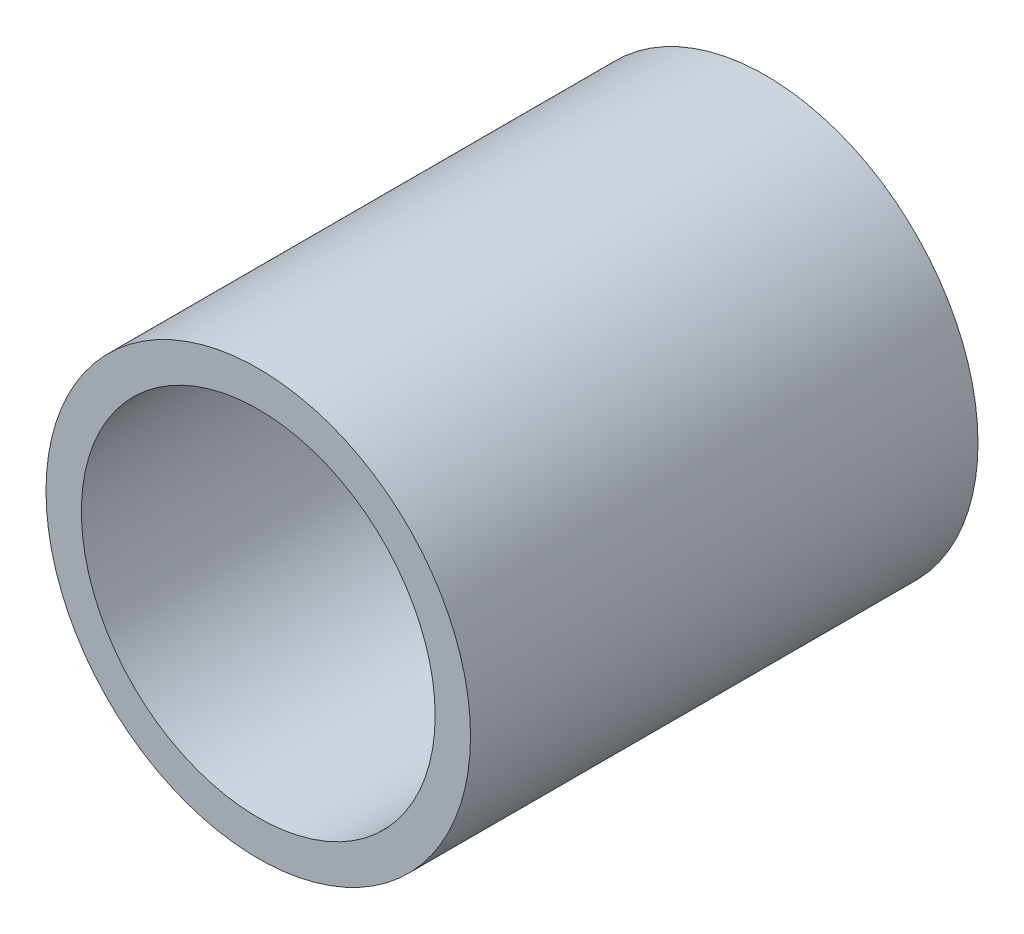
ISO-10303-21;
HEADER;
FILE_DESCRIPTION(('STEP AP214'),'2;1');
FILE_NAME('part.step','',(''),(''),'','','');
FILE_SCHEMA(('AUTOMOTIVE_DESIGN { 1 0 10303 214 1 1 1 1 }'));
ENDSEC;
DATA;
#1=APPLICATION_CONTEXT('core data for automotive mechanical design processes');
#2=APPLICATION_PROTOCOL_DEFINITION('international standard','automotive_design',2000,#1);
#3=PRODUCT_CONTEXT('',#1,'mechanical');
#4=PRODUCT('Part','Part','',(#3));
#5=PRODUCT_RELATED_PRODUCT_CATEGORY('part','',(#4));
#6=PRODUCT_DEFINITION_FORMATION('','',#4);
#7=PRODUCT_DEFINITION_CONTEXT('part definition',#1,'design');
#8=PRODUCT_DEFINITION('design','',#6,#7);
#9=PRODUCT_DEFINITION_SHAPE('','',#8);
#10=(LENGTH_UNIT() NAMED_UNIT(*) SI_UNIT(.MILLI.,.METRE.));
#11=(NAMED_UNIT(*) PLANE_ANGLE_UNIT() SI_UNIT($,.RADIAN.));
#12=(NAMED_UNIT(*) SI_UNIT($,.STERADIAN.) SOLID_ANGLE_UNIT());
#13=UNCERTAINTY_MEASURE_WITH_UNIT(LENGTH_MEASURE(1.E-05),#10,'distance_accuracy_value','');
#14=(GEOMETRIC_REPRESENTATION_CONTEXT(3) GLOBAL_UNCERTAINTY_ASSIGNED_CONTEXT((#13)) GLOBAL_UNIT_ASSIGNED_CONTEXT((#10,
#11,#12)) REPRESENTATION_CONTEXT('',''));
#15=CARTESIAN_POINT('',(0.,0.,0.));
#16=DIRECTION('',(0.,0.,1.));
#17=DIRECTION('',(1.,0.,0.));
#18=AXIS2_PLACEMENT_3D('',#15,#16,#17);
#19=CARTESIAN_POINT('',(0.,0.,31.3148908356842));
#20=DIRECTION('',(0.,0.,-1.));
#21=DIRECTION('',(-1.,0.,0.));
#22=AXIS2_PLACEMENT_3D('',#19,#20,#21);
#23=CYLINDRICAL_SURFACE('',#22,6.);
#24=CARTESIAN_POINT('',(0.,0.,0.));
#25=DIRECTION('',(0.,0.,1.));
#26=DIRECTION('',(1.,0.,0.));
#27=AXIS2_PLACEMENT_3D('',#24,#25,#26);
#28=CIRCLE('',#27,6.);
#29=CARTESIAN_POINT('',(6.,0.,0.));
#30=VERTEX_POINT('',#29);
#31=EDGE_CURVE('E42',#30,#30,#28,.T.);
#32=ORIENTED_EDGE('',*,*,#31,.T.);
#33=EDGE_LOOP('',(#32));
#34=FACE_BOUND('',#33,.T.);
#35=CARTESIAN_POINT('',(0.,0.,14.3443280872071));
#36=DIRECTION('',(0.,0.,1.));
#37=DIRECTION('',(1.,0.,0.));
#38=AXIS2_PLACEMENT_3D('',#35,#36,#37);
#39=CIRCLE('',#38,6.);
#40=CARTESIAN_POINT('',(6.,0.,14.3443280872071));
#41=VERTEX_POINT('',#40);
#42=EDGE_CURVE('E10',#41,#41,#39,.T.);
#43=ORIENTED_EDGE('',*,*,#42,.F.);
#44=EDGE_LOOP('',(#43));
#45=FACE_BOUND('',#44,.T.);
#46=ADVANCED_FACE('F35',(#34,#45),#23,.T.);
#47=CARTESIAN_POINT('',(0.,0.,0.));
#48=DIRECTION('',(0.,0.,1.));
#49=DIRECTION('',(1.,0.,0.));
#50=AXIS2_PLACEMENT_3D('',#47,#48,#49);
#51=PLANE('',#50);
#52=ORIENTED_EDGE('',*,*,#31,.F.);
#53=EDGE_LOOP('',(#52));
#54=FACE_BOUND('',#53,.T.);
#55=CARTESIAN_POINT('',(0.,0.,0.));
#56=DIRECTION('',(0.,0.,1.));
#57=DIRECTION('',(1.,0.,0.));
#58=AXIS2_PLACEMENT_3D('',#55,#56,#57);
#59=CIRCLE('',#58,5.);
#60=CARTESIAN_POINT('',(5.,0.,0.));
#61=VERTEX_POINT('',#60);
#62=EDGE_CURVE('E47',#61,#61,#59,.T.);
#63=ORIENTED_EDGE('',*,*,#62,.T.);
#64=EDGE_LOOP('',(#63));
#65=FACE_BOUND('',#64,.T.);
#66=ADVANCED_FACE('F63',(#54,#65),#51,.F.);
#67=CARTESIAN_POINT('',(0.,0.,31.3148908356842));
#68=DIRECTION('',(0.,0.,-1.));
#69=DIRECTION('',(-1.,0.,0.));
#70=AXIS2_PLACEMENT_3D('',#67,#68,#69);
#71=CYLINDRICAL_SURFACE('',#70,5.);
#72=ORIENTED_EDGE('',*,*,#62,.F.);
#73=EDGE_LOOP('',(#72));
#74=FACE_BOUND('',#73,.T.);
#75=CARTESIAN_POINT('',(0.,0.,14.3443280872071));
#76=DIRECTION('',(0.,0.,1.));
#77=DIRECTION('',(1.,0.,0.));
#78=AXIS2_PLACEMENT_3D('',#75,#76,#77);
#79=CIRCLE('',#78,5.);
#80=CARTESIAN_POINT('',(5.,0.,14.3443280872071));
#81=VERTEX_POINT('',#80);
#82=EDGE_CURVE('E38',#81,#81,#79,.T.);
#83=ORIENTED_EDGE('',*,*,#82,.T.);
#84=EDGE_LOOP('',(#83));
#85=FACE_BOUND('',#84,.T.);
#86=ADVANCED_FACE('F55',(#74,#85),#71,.F.);
#87=CARTESIAN_POINT('',(-4.97975213536354,-1.66269921222758,14.3443280872071));
#88=DIRECTION('',(0.,0.,1.));
#89=DIRECTION('',(-0.948524216259722,-0.316704611852873,0.));
#90=AXIS2_PLACEMENT_3D('',#87,#88,#89);
#91=PLANE('',#90);
#92=ORIENTED_EDGE('',*,*,#82,.F.);
#93=EDGE_LOOP('',(#92));
#94=FACE_BOUND('',#93,.T.);
#95=ORIENTED_EDGE('',*,*,#42,.T.);
#96=EDGE_LOOP('',(#95));
#97=FACE_BOUND('',#96,.T.);
#98=ADVANCED_FACE('F57',(#94,#97),#91,.T.);
#99=CLOSED_SHELL('',(#46,#66,#86,#98));
#100=MANIFOLD_SOLID_BREP('B2',#99);
#101=ADVANCED_BREP_SHAPE_REPRESENTATION('',(#18,#100),#14);
#102=SHAPE_DEFINITION_REPRESENTATION(#9,#101);
ENDSEC;
END-ISO-10303-21;
